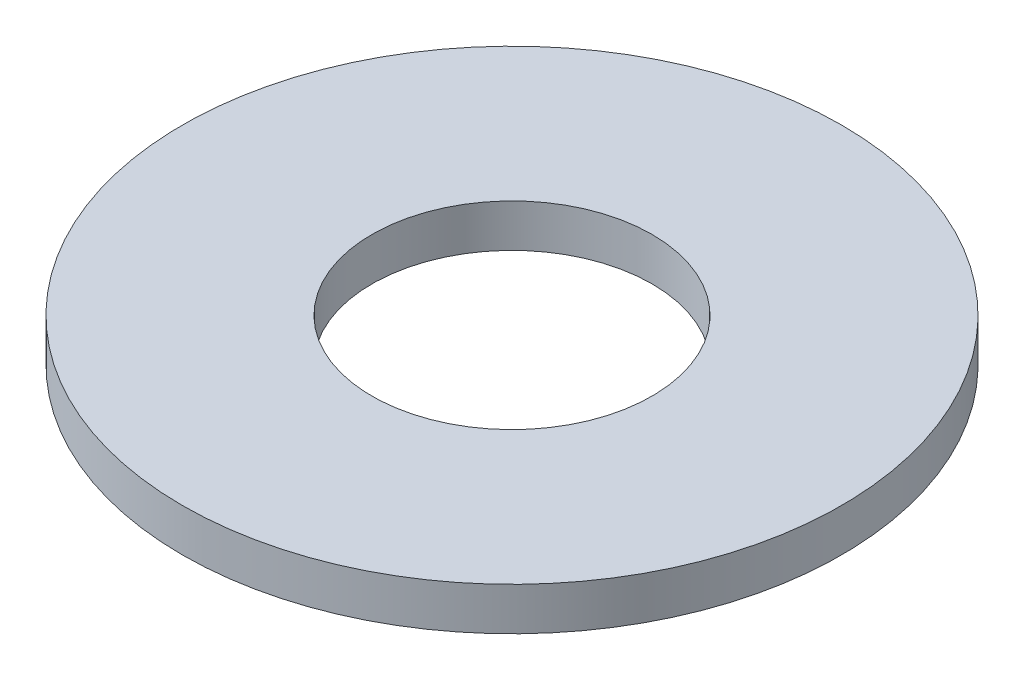
ISO-10303-21;
HEADER;
FILE_DESCRIPTION(('STEP AP214'),'2;1');
FILE_NAME('part.step','',(''),(''),'','','');
FILE_SCHEMA(('AUTOMOTIVE_DESIGN { 1 0 10303 214 1 1 1 1 }'));
ENDSEC;
DATA;
#1=APPLICATION_CONTEXT('core data for automotive mechanical design processes');
#2=APPLICATION_PROTOCOL_DEFINITION('international standard','automotive_design',2000,#1);
#3=PRODUCT_CONTEXT('',#1,'mechanical');
#4=PRODUCT('Part','Part','',(#3));
#5=PRODUCT_RELATED_PRODUCT_CATEGORY('part','',(#4));
#6=PRODUCT_DEFINITION_FORMATION('','',#4);
#7=PRODUCT_DEFINITION_CONTEXT('part definition',#1,'design');
#8=PRODUCT_DEFINITION('design','',#6,#7);
#9=PRODUCT_DEFINITION_SHAPE('','',#8);
#10=(LENGTH_UNIT() NAMED_UNIT(*) SI_UNIT(.MILLI.,.METRE.));
#11=(NAMED_UNIT(*) PLANE_ANGLE_UNIT() SI_UNIT($,.RADIAN.));
#12=(NAMED_UNIT(*) SI_UNIT($,.STERADIAN.) SOLID_ANGLE_UNIT());
#13=UNCERTAINTY_MEASURE_WITH_UNIT(LENGTH_MEASURE(1.E-05),#10,'distance_accuracy_value','');
#14=(GEOMETRIC_REPRESENTATION_CONTEXT(3) GLOBAL_UNCERTAINTY_ASSIGNED_CONTEXT((#13)) GLOBAL_UNIT_ASSIGNED_CONTEXT((#10,
#11,#12)) REPRESENTATION_CONTEXT('',''));
#15=CARTESIAN_POINT('',(0.,0.,0.));
#16=DIRECTION('',(0.,0.,1.));
#17=DIRECTION('',(1.,0.,0.));
#18=AXIS2_PLACEMENT_3D('',#15,#16,#17);
#19=CARTESIAN_POINT('',(0.,13.,0.));
#20=DIRECTION('',(0.,-1.,0.));
#21=DIRECTION('',(0.,0.,-1.));
#22=AXIS2_PLACEMENT_3D('',#19,#20,#21);
#23=CYLINDRICAL_SURFACE('',#22,100.);
#24=CARTESIAN_POINT('',(0.,13.,0.));
#25=DIRECTION('',(0.,1.,0.));
#26=DIRECTION('',(0.,0.,1.));
#27=AXIS2_PLACEMENT_3D('',#24,#25,#26);
#28=CIRCLE('',#27,100.);
#29=CARTESIAN_POINT('',(0.,13.,-100.));
#30=VERTEX_POINT('',#29);
#31=EDGE_CURVE('E10',#30,#30,#28,.T.);
#32=CARTESIAN_POINT('',(0.,0.,0.));
#33=DIRECTION('',(0.,1.,0.));
#34=DIRECTION('',(0.,0.,1.));
#35=AXIS2_PLACEMENT_3D('',#32,#33,#34);
#36=CIRCLE('',#35,100.);
#37=CARTESIAN_POINT('',(0.,0.,-100.));
#38=VERTEX_POINT('',#37);
#39=EDGE_CURVE('E37',#38,#38,#36,.T.);
#40=CARTESIAN_POINT('',(0.,13.,-100.));
#41=CARTESIAN_POINT('',(0.,12.8645833333333,-100.));
#42=CARTESIAN_POINT('',(0.,12.7291666666667,-100.));
#43=CARTESIAN_POINT('',(0.,12.4583333333333,-100.));
#44=CARTESIAN_POINT('',(0.,12.3229166666667,-100.));
#45=CARTESIAN_POINT('',(0.,12.0520833333333,-100.));
#46=CARTESIAN_POINT('',(0.,11.9166666666667,-100.));
#47=CARTESIAN_POINT('',(0.,11.6458333333333,-100.));
#48=CARTESIAN_POINT('',(0.,11.5104166666667,-100.));
#49=CARTESIAN_POINT('',(0.,11.2395833333333,-100.));
#50=CARTESIAN_POINT('',(0.,11.1041666666667,-100.));
#51=CARTESIAN_POINT('',(0.,10.8333333333333,-100.));
#52=CARTESIAN_POINT('',(0.,10.6979166666667,-100.));
#53=CARTESIAN_POINT('',(0.,10.4270833333333,-100.));
#54=CARTESIAN_POINT('',(0.,10.2916666666667,-100.));
#55=CARTESIAN_POINT('',(0.,10.0208333333333,-100.));
#56=CARTESIAN_POINT('',(0.,9.88541666666667,-100.));
#57=CARTESIAN_POINT('',(0.,9.61458333333333,-100.));
#58=CARTESIAN_POINT('',(0.,9.47916666666667,-100.));
#59=CARTESIAN_POINT('',(0.,9.20833333333333,-100.));
#60=CARTESIAN_POINT('',(0.,9.07291666666666,-100.));
#61=CARTESIAN_POINT('',(0.,8.80208333333333,-100.));
#62=CARTESIAN_POINT('',(0.,8.66666666666667,-100.));
#63=CARTESIAN_POINT('',(0.,8.39583333333333,-100.));
#64=CARTESIAN_POINT('',(0.,8.26041666666667,-100.));
#65=CARTESIAN_POINT('',(0.,7.98958333333333,-100.));
#66=CARTESIAN_POINT('',(0.,7.85416666666667,-100.));
#67=CARTESIAN_POINT('',(0.,7.58333333333333,-100.));
#68=CARTESIAN_POINT('',(0.,7.44791666666667,-100.));
#69=CARTESIAN_POINT('',(0.,7.17708333333333,-100.));
#70=CARTESIAN_POINT('',(0.,7.04166666666667,-100.));
#71=CARTESIAN_POINT('',(0.,6.77083333333333,-100.));
#72=CARTESIAN_POINT('',(0.,6.63541666666667,-100.));
#73=CARTESIAN_POINT('',(0.,6.36458333333333,-100.));
#74=CARTESIAN_POINT('',(0.,6.22916666666667,-100.));
#75=CARTESIAN_POINT('',(0.,5.95833333333333,-100.));
#76=CARTESIAN_POINT('',(0.,5.82291666666667,-100.));
#77=CARTESIAN_POINT('',(0.,5.55208333333333,-100.));
#78=CARTESIAN_POINT('',(0.,5.41666666666667,-100.));
#79=CARTESIAN_POINT('',(0.,5.14583333333333,-100.));
#80=CARTESIAN_POINT('',(0.,5.01041666666667,-100.));
#81=CARTESIAN_POINT('',(0.,4.73958333333333,-100.));
#82=CARTESIAN_POINT('',(0.,4.60416666666667,-100.));
#83=CARTESIAN_POINT('',(0.,4.33333333333333,-100.));
#84=CARTESIAN_POINT('',(0.,4.19791666666667,-100.));
#85=CARTESIAN_POINT('',(0.,3.92708333333333,-100.));
#86=CARTESIAN_POINT('',(0.,3.79166666666667,-100.));
#87=CARTESIAN_POINT('',(0.,3.52083333333333,-100.));
#88=CARTESIAN_POINT('',(0.,3.38541666666667,-100.));
#89=CARTESIAN_POINT('',(0.,3.11458333333333,-100.));
#90=CARTESIAN_POINT('',(0.,2.97916666666667,-100.));
#91=CARTESIAN_POINT('',(0.,2.70833333333333,-100.));
#92=CARTESIAN_POINT('',(0.,2.57291666666667,-100.));
#93=CARTESIAN_POINT('',(0.,2.30208333333333,-100.));
#94=CARTESIAN_POINT('',(0.,2.16666666666667,-100.));
#95=CARTESIAN_POINT('',(0.,1.89583333333333,-100.));
#96=CARTESIAN_POINT('',(0.,1.76041666666667,-100.));
#97=CARTESIAN_POINT('',(0.,1.48958333333333,-100.));
#98=CARTESIAN_POINT('',(0.,1.35416666666667,-100.));
#99=CARTESIAN_POINT('',(0.,1.08333333333333,-100.));
#100=CARTESIAN_POINT('',(0.,0.947916666666667,-100.));
#101=CARTESIAN_POINT('',(0.,0.677083333333334,-100.));
#102=CARTESIAN_POINT('',(0.,0.541666666666667,-100.));
#103=CARTESIAN_POINT('',(0.,0.270833333333334,-100.));
#104=CARTESIAN_POINT('',(0.,0.135416666666667,-100.));
#105=CARTESIAN_POINT('',(0.,0.,-100.));
#106=B_SPLINE_CURVE_WITH_KNOTS('',3,(#40,#41,#42,#43,#44,#45,#46,#47,#48,#49,#50,#51,#52,#53,
#54,#55,#56,#57,#58,#59,#60,#61,#62,#63,#64,#65,#66,#67,#68,#69,#70,#71,#72,#73,#74,#75,#76,#77,
#78,#79,#80,#81,#82,#83,#84,#85,#86,#87,#88,#89,#90,#91,#92,#93,#94,#95,#96,#97,#98,#99,#100,
#101,#102,#103,#104,#105),.UNSPECIFIED.,.F.,.F.,(4,2,2,2,2,2,2,2,2,2,2,2,2,2,2,2,2,2,2,2,2,2,2,
2,2,2,2,2,2,2,2,2,4),(0.,0.40625,0.812500000000001,1.21875,1.625,2.03125,2.4375,2.84375,3.25,
3.65625,4.0625,4.46875,4.875,5.28125,5.6875,6.09375,6.5,6.90625,7.3125,7.71875,8.125,8.53125,
8.9375,9.34375,9.75,10.15625,10.5625,10.96875,11.375,11.78125,12.1875,12.59375,13.),.UNSPECIFIED.);
#107=EDGE_CURVE('BSEAM40',#30,#38,#106,.T.);
#108=ORIENTED_EDGE('',*,*,#31,.F.);
#109=ORIENTED_EDGE('',*,*,#39,.T.);
#110=ORIENTED_EDGE('',*,*,#107,.T.);
#111=ORIENTED_EDGE('',*,*,#107,.F.);
#112=EDGE_LOOP('',(#108,#110,#109,#111));
#113=FACE_BOUND('',#112,.T.);
#114=ADVANCED_FACE('F40',(#113),#23,.T.);
#115=CARTESIAN_POINT('',(0.,13.,0.));
#116=DIRECTION('',(0.,1.,0.));
#117=DIRECTION('',(0.,0.,1.));
#118=AXIS2_PLACEMENT_3D('',#115,#116,#117);
#119=PLANE('',#118);
#120=CARTESIAN_POINT('',(0.,13.,0.));
#121=DIRECTION('',(0.,1.,0.));
#122=DIRECTION('',(0.,0.,1.));
#123=AXIS2_PLACEMENT_3D('',#120,#121,#122);
#124=CIRCLE('',#123,42.5);
#125=CARTESIAN_POINT('',(0.,13.,-42.5));
#126=VERTEX_POINT('',#125);
#127=EDGE_CURVE('E50',#126,#126,#124,.T.);
#128=ORIENTED_EDGE('',*,*,#127,.F.);
#129=EDGE_LOOP('',(#128));
#130=FACE_BOUND('',#129,.T.);
#131=ORIENTED_EDGE('',*,*,#31,.T.);
#132=EDGE_LOOP('',(#131));
#133=FACE_BOUND('',#132,.T.);
#134=ADVANCED_FACE('F59',(#130,#133),#119,.T.);
#135=CARTESIAN_POINT('',(0.,0.,0.));
#136=DIRECTION('',(0.,1.,0.));
#137=DIRECTION('',(0.,0.,1.));
#138=AXIS2_PLACEMENT_3D('',#135,#136,#137);
#139=PLANE('',#138);
#140=CARTESIAN_POINT('',(0.,0.,0.));
#141=DIRECTION('',(0.,1.,0.));
#142=DIRECTION('',(0.,0.,1.));
#143=AXIS2_PLACEMENT_3D('',#140,#141,#142);
#144=CIRCLE('',#143,42.5);
#145=CARTESIAN_POINT('',(0.,0.,-42.5));
#146=VERTEX_POINT('',#145);
#147=EDGE_CURVE('E47',#146,#146,#144,.T.);
#148=ORIENTED_EDGE('',*,*,#147,.T.);
#149=EDGE_LOOP('',(#148));
#150=FACE_BOUND('',#149,.T.);
#151=ORIENTED_EDGE('',*,*,#39,.F.);
#152=EDGE_LOOP('',(#151));
#153=FACE_BOUND('',#152,.T.);
#154=ADVANCED_FACE('F58',(#150,#153),#139,.F.);
#155=CARTESIAN_POINT('',(0.,13.,0.));
#156=DIRECTION('',(0.,-1.,0.));
#157=DIRECTION('',(0.,0.,-1.));
#158=AXIS2_PLACEMENT_3D('',#155,#156,#157);
#159=CYLINDRICAL_SURFACE('',#158,42.5);
#160=CARTESIAN_POINT('',(0.,13.,-42.5));
#161=CARTESIAN_POINT('',(0.,12.8645833333333,-42.5));
#162=CARTESIAN_POINT('',(0.,12.7291666666667,-42.5));
#163=CARTESIAN_POINT('',(0.,12.4583333333333,-42.5));
#164=CARTESIAN_POINT('',(0.,12.3229166666667,-42.5));
#165=CARTESIAN_POINT('',(0.,12.0520833333333,-42.5));
#166=CARTESIAN_POINT('',(0.,11.9166666666667,-42.5));
#167=CARTESIAN_POINT('',(0.,11.6458333333333,-42.5));
#168=CARTESIAN_POINT('',(0.,11.5104166666667,-42.5));
#169=CARTESIAN_POINT('',(0.,11.2395833333333,-42.5));
#170=CARTESIAN_POINT('',(0.,11.1041666666667,-42.5));
#171=CARTESIAN_POINT('',(0.,10.8333333333333,-42.5));
#172=CARTESIAN_POINT('',(0.,10.6979166666667,-42.5));
#173=CARTESIAN_POINT('',(0.,10.4270833333333,-42.5));
#174=CARTESIAN_POINT('',(0.,10.2916666666667,-42.5));
#175=CARTESIAN_POINT('',(0.,10.0208333333333,-42.5));
#176=CARTESIAN_POINT('',(0.,9.88541666666667,-42.5));
#177=CARTESIAN_POINT('',(0.,9.61458333333333,-42.5));
#178=CARTESIAN_POINT('',(0.,9.47916666666667,-42.5));
#179=CARTESIAN_POINT('',(0.,9.20833333333333,-42.5));
#180=CARTESIAN_POINT('',(0.,9.07291666666666,-42.5));
#181=CARTESIAN_POINT('',(0.,8.80208333333333,-42.5));
#182=CARTESIAN_POINT('',(0.,8.66666666666667,-42.5));
#183=CARTESIAN_POINT('',(0.,8.39583333333333,-42.5));
#184=CARTESIAN_POINT('',(0.,8.26041666666667,-42.5));
#185=CARTESIAN_POINT('',(0.,7.98958333333333,-42.5));
#186=CARTESIAN_POINT('',(0.,7.85416666666667,-42.5));
#187=CARTESIAN_POINT('',(0.,7.58333333333333,-42.5));
#188=CARTESIAN_POINT('',(0.,7.44791666666667,-42.5));
#189=CARTESIAN_POINT('',(0.,7.17708333333333,-42.5));
#190=CARTESIAN_POINT('',(0.,7.04166666666667,-42.5));
#191=CARTESIAN_POINT('',(0.,6.77083333333333,-42.5));
#192=CARTESIAN_POINT('',(0.,6.63541666666667,-42.5));
#193=CARTESIAN_POINT('',(0.,6.36458333333333,-42.5));
#194=CARTESIAN_POINT('',(0.,6.22916666666667,-42.5));
#195=CARTESIAN_POINT('',(0.,5.95833333333333,-42.5));
#196=CARTESIAN_POINT('',(0.,5.82291666666667,-42.5));
#197=CARTESIAN_POINT('',(0.,5.55208333333333,-42.5));
#198=CARTESIAN_POINT('',(0.,5.41666666666667,-42.5));
#199=CARTESIAN_POINT('',(0.,5.14583333333333,-42.5));
#200=CARTESIAN_POINT('',(0.,5.01041666666667,-42.5));
#201=CARTESIAN_POINT('',(0.,4.73958333333333,-42.5));
#202=CARTESIAN_POINT('',(0.,4.60416666666667,-42.5));
#203=CARTESIAN_POINT('',(0.,4.33333333333333,-42.5));
#204=CARTESIAN_POINT('',(0.,4.19791666666667,-42.5));
#205=CARTESIAN_POINT('',(0.,3.92708333333333,-42.5));
#206=CARTESIAN_POINT('',(0.,3.79166666666667,-42.5));
#207=CARTESIAN_POINT('',(0.,3.52083333333333,-42.5));
#208=CARTESIAN_POINT('',(0.,3.38541666666667,-42.5));
#209=CARTESIAN_POINT('',(0.,3.11458333333333,-42.5));
#210=CARTESIAN_POINT('',(0.,2.97916666666667,-42.5));
#211=CARTESIAN_POINT('',(0.,2.70833333333333,-42.5));
#212=CARTESIAN_POINT('',(0.,2.57291666666667,-42.5));
#213=CARTESIAN_POINT('',(0.,2.30208333333333,-42.5));
#214=CARTESIAN_POINT('',(0.,2.16666666666667,-42.5));
#215=CARTESIAN_POINT('',(0.,1.89583333333333,-42.5));
#216=CARTESIAN_POINT('',(0.,1.76041666666667,-42.5));
#217=CARTESIAN_POINT('',(0.,1.48958333333333,-42.5));
#218=CARTESIAN_POINT('',(0.,1.35416666666667,-42.5));
#219=CARTESIAN_POINT('',(0.,1.08333333333333,-42.5));
#220=CARTESIAN_POINT('',(0.,0.947916666666667,-42.5));
#221=CARTESIAN_POINT('',(0.,0.677083333333334,-42.5));
#222=CARTESIAN_POINT('',(0.,0.541666666666667,-42.5));
#223=CARTESIAN_POINT('',(0.,0.270833333333334,-42.5));
#224=CARTESIAN_POINT('',(0.,0.135416666666667,-42.5));
#225=CARTESIAN_POINT('',(0.,0.,-42.5));
#226=B_SPLINE_CURVE_WITH_KNOTS('',3,(#160,#161,#162,#163,#164,#165,#166,#167,#168,#169,#170,
#171,#172,#173,#174,#175,#176,#177,#178,#179,#180,#181,#182,#183,#184,#185,#186,#187,#188,#189,
#190,#191,#192,#193,#194,#195,#196,#197,#198,#199,#200,#201,#202,#203,#204,#205,#206,#207,#208,
#209,#210,#211,#212,#213,#214,#215,#216,#217,#218,#219,#220,#221,#222,#223,#224,#225),
.UNSPECIFIED.,.F.,.F.,(4,2,2,2,2,2,2,2,2,2,2,2,2,2,2,2,2,2,2,2,2,2,2,2,2,2,2,2,2,2,2,2,4),(0.,
0.40625,0.812500000000001,1.21875,1.625,2.03125,2.4375,2.84375,3.25,3.65625,4.0625,4.46875,
4.875,5.28125,5.6875,6.09375,6.5,6.90625,7.3125,7.71875,8.125,8.53125,8.9375,9.34375,9.75,
10.15625,10.5625,10.96875,11.375,11.78125,12.1875,12.59375,13.),.UNSPECIFIED.);
#227=EDGE_CURVE('BSEAM54',#126,#146,#226,.T.);
#228=ORIENTED_EDGE('',*,*,#127,.T.);
#229=ORIENTED_EDGE('',*,*,#147,.F.);
#230=ORIENTED_EDGE('',*,*,#227,.T.);
#231=ORIENTED_EDGE('',*,*,#227,.F.);
#232=EDGE_LOOP('',(#228,#230,#229,#231));
#233=FACE_BOUND('',#232,.T.);
#234=ADVANCED_FACE('F54',(#233),#159,.F.);
#235=CLOSED_SHELL('',(#114,#134,#154,#234));
#236=MANIFOLD_SOLID_BREP('B2',#235);
#237=ADVANCED_BREP_SHAPE_REPRESENTATION('',(#18,#236),#14);
#238=SHAPE_DEFINITION_REPRESENTATION(#9,#237);
ENDSEC;
END-ISO-10303-21;
